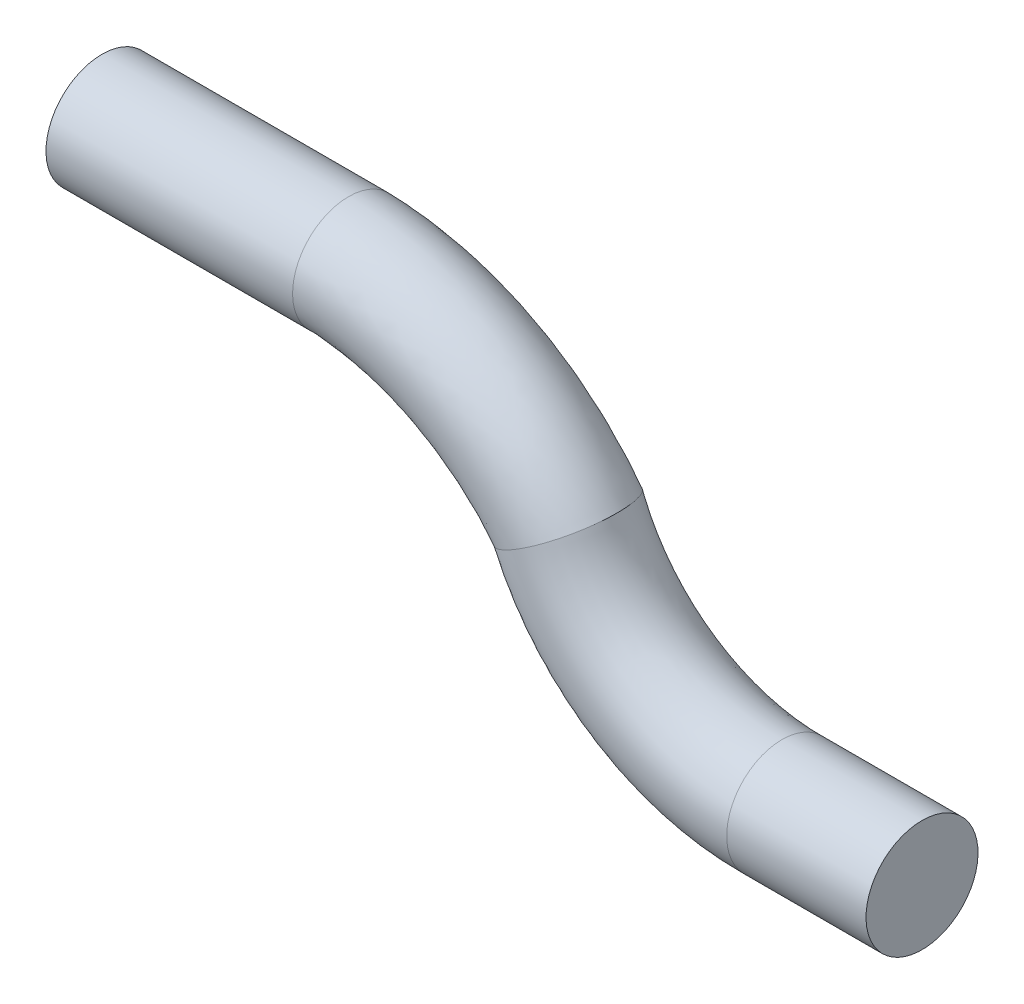
ISO-10303-21;
HEADER;
FILE_DESCRIPTION(('STEP AP214'),'2;1');
FILE_NAME('part.step','',(''),(''),'','','');
FILE_SCHEMA(('AUTOMOTIVE_DESIGN { 1 0 10303 214 1 1 1 1 }'));
ENDSEC;
DATA;
#1=APPLICATION_CONTEXT('core data for automotive mechanical design processes');
#2=APPLICATION_PROTOCOL_DEFINITION('international standard','automotive_design',2000,#1);
#3=PRODUCT_CONTEXT('',#1,'mechanical');
#4=PRODUCT('Part','Part','',(#3));
#5=PRODUCT_RELATED_PRODUCT_CATEGORY('part','',(#4));
#6=PRODUCT_DEFINITION_FORMATION('','',#4);
#7=PRODUCT_DEFINITION_CONTEXT('part definition',#1,'design');
#8=PRODUCT_DEFINITION('design','',#6,#7);
#9=PRODUCT_DEFINITION_SHAPE('','',#8);
#10=(LENGTH_UNIT() NAMED_UNIT(*) SI_UNIT(.MILLI.,.METRE.));
#11=(NAMED_UNIT(*) PLANE_ANGLE_UNIT() SI_UNIT($,.RADIAN.));
#12=(NAMED_UNIT(*) SI_UNIT($,.STERADIAN.) SOLID_ANGLE_UNIT());
#13=UNCERTAINTY_MEASURE_WITH_UNIT(LENGTH_MEASURE(1.E-05),#10,'distance_accuracy_value','');
#14=(GEOMETRIC_REPRESENTATION_CONTEXT(3) GLOBAL_UNCERTAINTY_ASSIGNED_CONTEXT((#13)) GLOBAL_UNIT_ASSIGNED_CONTEXT((#10,
#11,#12)) REPRESENTATION_CONTEXT('',''));
#15=CARTESIAN_POINT('',(0.,0.,0.));
#16=DIRECTION('',(0.,0.,1.));
#17=DIRECTION('',(1.,0.,0.));
#18=AXIS2_PLACEMENT_3D('',#15,#16,#17);
#19=CARTESIAN_POINT('',(271.907836607227,146.761167818452,0.));
#20=DIRECTION('',(1.,0.,0.));
#21=DIRECTION('',(0.,1.,0.));
#22=AXIS2_PLACEMENT_3D('',#19,#20,#21);
#23=PLANE('',#22);
#24=CARTESIAN_POINT('',(271.907836607227,146.761167818452,0.));
#25=DIRECTION('',(1.,0.,0.));
#26=DIRECTION('',(0.,1.,0.));
#27=AXIS2_PLACEMENT_3D('',#24,#25,#26);
#28=CIRCLE('',#27,0.508);
#29=CARTESIAN_POINT('',(271.907836607227,147.269167818452,0.));
#30=VERTEX_POINT('',#29);
#31=EDGE_CURVE('E123',#30,#30,#28,.T.);
#32=ORIENTED_EDGE('',*,*,#31,.T.);
#33=EDGE_LOOP('',(#32));
#34=FACE_BOUND('',#33,.T.);
#35=ADVANCED_FACE('F51',(#34),#23,.T.);
#36=CARTESIAN_POINT('',(264.468981006446,149.061167818451,0.));
#37=DIRECTION('',(1.,0.,0.));
#38=DIRECTION('',(0.,1.,0.));
#39=AXIS2_PLACEMENT_3D('',#36,#37,#38);
#40=PLANE('',#39);
#41=CARTESIAN_POINT('',(264.468981006446,149.061167818451,0.));
#42=DIRECTION('',(1.,0.,0.));
#43=DIRECTION('',(0.,1.,0.));
#44=AXIS2_PLACEMENT_3D('',#41,#42,#43);
#45=CIRCLE('',#44,0.508);
#46=CARTESIAN_POINT('',(264.468981006446,149.569167818451,0.));
#47=VERTEX_POINT('',#46);
#48=EDGE_CURVE('E61',#47,#47,#45,.T.);
#49=ORIENTED_EDGE('',*,*,#48,.F.);
#50=EDGE_LOOP('',(#49));
#51=FACE_BOUND('',#50,.T.);
#52=ADVANCED_FACE('F139',(#51),#40,.F.);
#53=CARTESIAN_POINT('',(270.644067449418,146.761167818452,0.));
#54=DIRECTION('',(1.,0.,0.));
#55=DIRECTION('',(0.,0.,-1.));
#56=AXIS2_PLACEMENT_3D('',#53,#54,#55);
#57=CYLINDRICAL_SURFACE('',#56,0.508);
#58=ORIENTED_EDGE('',*,*,#31,.F.);
#59=EDGE_LOOP('',(#58));
#60=FACE_BOUND('',#59,.T.);
#61=CARTESIAN_POINT('',(270.644067449418,146.761167818452,0.));
#62=DIRECTION('',(0.999910528985932,0.0133766222594766,0.));
#63=DIRECTION('',(-0.0133766222594766,0.999910528985932,0.));
#64=AXIS2_PLACEMENT_3D('',#61,#62,#63);
#65=CIRCLE('',#64,0.508);
#66=CARTESIAN_POINT('',(270.63727212531,147.269122367176,0.));
#67=VERTEX_POINT('',#66);
#68=EDGE_CURVE('E54',#67,#67,#65,.T.);
#69=ORIENTED_EDGE('',*,*,#68,.T.);
#70=EDGE_LOOP('',(#69));
#71=FACE_BOUND('',#70,.T.);
#72=ADVANCED_FACE('F141',(#60,#71),#57,.T.);
#73=CARTESIAN_POINT('',(269.091853438588,148.423831237104,0.));
#74=CARTESIAN_POINT('',(269.117237446685,148.362186313736,0.));
#75=CARTESIAN_POINT('',(269.145724435752,148.292989885013,0.));
#76=CARTESIAN_POINT('',(269.203163655456,148.153540132283,0.));
#77=CARTESIAN_POINT('',(269.233788160211,148.094996057545,0.));
#78=CARTESIAN_POINT('',(269.314478388299,147.96085276086,0.));
#79=CARTESIAN_POINT('',(269.359636370496,147.897161631772,0.));
#80=CARTESIAN_POINT('',(269.508087284083,147.717588265722,0.));
#81=CARTESIAN_POINT('',(269.624440210598,147.613242349391,0.));
#82=CARTESIAN_POINT('',(270.011623301246,147.357686198297,0.));
#83=CARTESIAN_POINT('',(270.319566812847,147.264872172266,0.));
#84=CARTESIAN_POINT('',(270.63727212531,147.269122367177,0.));
#85=CARTESIAN_POINT('',(269.091853438588,148.423831237104,1.016));
#86=CARTESIAN_POINT('',(269.117237446685,148.362186313736,1.016));
#87=CARTESIAN_POINT('',(269.145724435752,148.292989885013,1.016));
#88=CARTESIAN_POINT('',(269.203163655456,148.153540132283,1.016));
#89=CARTESIAN_POINT('',(269.233788160211,148.094996057545,1.016));
#90=CARTESIAN_POINT('',(269.314478388299,147.96085276086,1.016));
#91=CARTESIAN_POINT('',(269.359636370496,147.897161631772,1.016));
#92=CARTESIAN_POINT('',(269.508087284083,147.717588265722,1.016));
#93=CARTESIAN_POINT('',(269.624440210598,147.613242349391,1.016));
#94=CARTESIAN_POINT('',(270.011623301246,147.357686198297,1.016));
#95=CARTESIAN_POINT('',(270.319566812847,147.264872172266,1.016));
#96=CARTESIAN_POINT('',(270.63727212531,147.269122367177,1.016));
#97=CARTESIAN_POINT('',(268.152384806404,148.036978953741,1.016));
#98=CARTESIAN_POINT('',(268.177768814502,147.975334030373,1.016));
#99=CARTESIAN_POINT('',(268.20003575675,147.921232615692,1.016));
#100=CARTESIAN_POINT('',(268.273509903114,147.742868775952,1.016));
#101=CARTESIAN_POINT('',(268.336990345924,147.614800867698,1.016));
#102=CARTESIAN_POINT('',(268.470021359161,147.393643744945,1.016));
#103=CARTESIAN_POINT('',(268.544471664611,147.288638521412,1.016));
#104=CARTESIAN_POINT('',(268.789217229468,146.992582513104,1.016));
#105=CARTESIAN_POINT('',(268.981044022806,146.820551236128,1.016));
#106=CARTESIAN_POINT('',(269.61937855329,146.399225202889,1.016));
#107=CARTESIAN_POINT('',(270.127073702297,146.2462061296,1.016));
#108=CARTESIAN_POINT('',(270.650862773526,146.253213269727,1.016));
#109=CARTESIAN_POINT('',(268.152384806404,148.036978953741,0.));
#110=CARTESIAN_POINT('',(268.177768814502,147.975334030373,0.));
#111=CARTESIAN_POINT('',(268.20003575675,147.921232615692,0.));
#112=CARTESIAN_POINT('',(268.273509903114,147.742868775952,0.));
#113=CARTESIAN_POINT('',(268.336990345924,147.614800867698,0.));
#114=CARTESIAN_POINT('',(268.470021359161,147.393643744945,0.));
#115=CARTESIAN_POINT('',(268.544471664611,147.288638521412,0.));
#116=CARTESIAN_POINT('',(268.789217229468,146.992582513104,0.));
#117=CARTESIAN_POINT('',(268.981044022806,146.820551236128,0.));
#118=CARTESIAN_POINT('',(269.61937855329,146.399225202889,0.));
#119=CARTESIAN_POINT('',(270.127073702297,146.2462061296,0.));
#120=CARTESIAN_POINT('',(270.650862773526,146.253213269727,0.));
#121=CARTESIAN_POINT('',(268.152384806404,148.036978953741,-1.016));
#122=CARTESIAN_POINT('',(268.177768814502,147.975334030373,-1.016));
#123=CARTESIAN_POINT('',(268.20003575675,147.921232615692,-1.016));
#124=CARTESIAN_POINT('',(268.273509903114,147.742868775952,-1.016));
#125=CARTESIAN_POINT('',(268.336990345924,147.614800867698,-1.016));
#126=CARTESIAN_POINT('',(268.470021359161,147.393643744945,-1.016));
#127=CARTESIAN_POINT('',(268.544471664611,147.288638521412,-1.016));
#128=CARTESIAN_POINT('',(268.789217229468,146.992582513104,-1.016));
#129=CARTESIAN_POINT('',(268.981044022806,146.820551236128,-1.016));
#130=CARTESIAN_POINT('',(269.61937855329,146.399225202889,-1.016));
#131=CARTESIAN_POINT('',(270.127073702297,146.2462061296,-1.016));
#132=CARTESIAN_POINT('',(270.650862773526,146.253213269727,-1.016));
#133=CARTESIAN_POINT('',(269.091853438588,148.423831237104,-1.016));
#134=CARTESIAN_POINT('',(269.117237446685,148.362186313736,-1.016));
#135=CARTESIAN_POINT('',(269.145724435752,148.292989885013,-1.016));
#136=CARTESIAN_POINT('',(269.203163655456,148.153540132283,-1.016));
#137=CARTESIAN_POINT('',(269.233788160211,148.094996057545,-1.016));
#138=CARTESIAN_POINT('',(269.314478388299,147.96085276086,-1.016));
#139=CARTESIAN_POINT('',(269.359636370496,147.897161631772,-1.016));
#140=CARTESIAN_POINT('',(269.508087284083,147.717588265722,-1.016));
#141=CARTESIAN_POINT('',(269.624440210598,147.613242349391,-1.016));
#142=CARTESIAN_POINT('',(270.011623301246,147.357686198297,-1.016));
#143=CARTESIAN_POINT('',(270.319566812847,147.264872172266,-1.016));
#144=CARTESIAN_POINT('',(270.63727212531,147.269122367177,-1.016));
#145=CARTESIAN_POINT('',(269.091853438588,148.423831237104,0.));
#146=CARTESIAN_POINT('',(269.117237446685,148.362186313736,0.));
#147=CARTESIAN_POINT('',(269.145724435752,148.292989885013,0.));
#148=CARTESIAN_POINT('',(269.203163655456,148.153540132283,0.));
#149=CARTESIAN_POINT('',(269.233788160211,148.094996057545,0.));
#150=CARTESIAN_POINT('',(269.314478388299,147.96085276086,0.));
#151=CARTESIAN_POINT('',(269.359636370496,147.897161631772,0.));
#152=CARTESIAN_POINT('',(269.508087284083,147.717588265722,0.));
#153=CARTESIAN_POINT('',(269.624440210598,147.613242349391,0.));
#154=CARTESIAN_POINT('',(270.011623301246,147.357686198297,0.));
#155=CARTESIAN_POINT('',(270.319566812847,147.264872172266,0.));
#156=CARTESIAN_POINT('',(270.63727212531,147.269122367177,0.));
#157=(BOUNDED_SURFACE() B_SPLINE_SURFACE(3,3,((#73,#74,#75,#76,#77,#78,#79,#80,#81,#82,#83,#84),
(#85,#86,#87,#88,#89,#90,#91,#92,#93,#94,#95,#96),(#97,#98,#99,#100,#101,#102,#103,#104,#105,
#106,#107,#108),(#109,#110,#111,#112,#113,#114,#115,#116,#117,#118,#119,#120),(#121,#122,#123,
#124,#125,#126,#127,#128,#129,#130,#131,#132),(#133,#134,#135,#136,#137,#138,#139,#140,#141,
#142,#143,#144),(#145,#146,#147,#148,#149,#150,#151,#152,#153,#154,#155,#156)),.UNSPECIFIED.,
.T.,.F.,.F.) B_SPLINE_SURFACE_WITH_KNOTS((4,3,4),(4,2,2,2,2,4),(0.,0.5,1.),(-0.0792170525621937,
0.,0.125,0.25,0.5,1.),
.UNSPECIFIED.) GEOMETRIC_REPRESENTATION_ITEM() RATIONAL_B_SPLINE_SURFACE(((1.,1.,1.,1.,1.,1.,1.,
1.,1.,1.,1.,1.),(0.333333333333333,0.333333333333333,0.333333333333333,0.333333333333333,
0.333333333333333,0.333333333333333,0.333333333333333,0.333333333333333,0.333333333333333,
0.333333333333333,0.333333333333333,0.333333333333333),(0.333333333333333,0.333333333333333,
0.333333333333333,0.333333333333333,0.333333333333333,0.333333333333333,0.333333333333333,
0.333333333333333,0.333333333333333,0.333333333333333,0.333333333333333,0.333333333333333),(1.,
1.,1.,1.,1.,1.,1.,1.,1.,1.,1.,1.),(0.333333333333333,0.333333333333333,0.333333333333333,
0.333333333333333,0.333333333333333,0.333333333333333,0.333333333333333,0.333333333333333,
0.333333333333333,0.333333333333333,0.333333333333333,0.333333333333333),(0.333333333333333,
0.333333333333333,0.333333333333333,0.333333333333333,0.333333333333333,0.333333333333333,
0.333333333333333,0.333333333333333,0.333333333333333,0.333333333333333,0.333333333333333,
0.333333333333333),(1.,1.,1.,1.,1.,1.,1.,1.,1.,1.,1.,1.))) REPRESENTATION_ITEM('') SURFACE());
#158=CARTESIAN_POINT('',(268.69827114678,148.045470325308,-0.508));
#159=CARTESIAN_POINT('',(268.700802021401,148.046934073896,-0.508000126012944));
#160=CARTESIAN_POINT('',(268.703333387043,148.048398101966,-0.507975312492676));
#161=CARTESIAN_POINT('',(268.730914551733,148.064349759092,-0.507433654173156));
#162=CARTESIAN_POINT('',(268.755971246846,148.078840945927,-0.504503439107406));
#163=CARTESIAN_POINT('',(268.805350082667,148.107397729755,-0.493827790988958));
#164=CARTESIAN_POINT('',(268.82967010621,148.121462100277,-0.48606964788327));
#165=CARTESIAN_POINT('',(268.87681337888,148.148724625947,-0.465948513078156));
#166=CARTESIAN_POINT('',(268.899638324636,148.161923762984,-0.453590851286754));
#167=CARTESIAN_POINT('',(268.943158270964,148.187089877168,-0.424605203263094));
#168=CARTESIAN_POINT('',(268.963853152723,148.199056785584,-0.407976979004063));
#169=CARTESIAN_POINT('',(269.002423150721,148.221359749554,-0.370992464790322));
#170=CARTESIAN_POINT('',(269.020310146738,148.231702675994,-0.350652714486624));
#171=CARTESIAN_POINT('',(269.052845159875,148.250515443119,-0.306764052580676));
#172=CARTESIAN_POINT('',(269.067492917754,148.258985133885,-0.283214884367068));
#173=CARTESIAN_POINT('',(269.092996086557,148.273731589872,-0.233795404930973));
#174=CARTESIAN_POINT('',(269.103883135528,148.28002664983,-0.20794687982292));
#175=CARTESIAN_POINT('',(269.121711900865,148.290335477874,-0.154494388125926));
#176=CARTESIAN_POINT('',(269.128653866137,148.294349389885,-0.126890532408309));
#177=CARTESIAN_POINT('',(269.138344489264,148.299952594525,-0.0709416740323016));
#178=CARTESIAN_POINT('',(269.141125377454,148.301560523112,-0.0426041159351496));
#179=CARTESIAN_POINT('',(269.142512806573,148.302362744695,0.0142067001503099));
#180=CARTESIAN_POINT('',(269.141119457772,148.301557101451,0.0426799545340638));
#181=CARTESIAN_POINT('',(269.134213032068,148.297563750306,0.0988472364798038));
#182=CARTESIAN_POINT('',(269.128714683225,148.294384558307,0.126543683393451));
#183=CARTESIAN_POINT('',(269.11377907239,148.285748617266,0.180481372838089));
#184=CARTESIAN_POINT('',(269.10434169529,148.280291801669,0.206722572817833));
#185=CARTESIAN_POINT('',(269.081780942272,148.267246777471,0.257071351433603));
#186=CARTESIAN_POINT('',(269.068649403898,148.259653849008,0.281174048016246));
#187=CARTESIAN_POINT('',(269.039093580099,148.242563874487,0.326511601989786));
#188=CARTESIAN_POINT('',(269.022669429995,148.23306690668,0.347746577179447));
#189=CARTESIAN_POINT('',(268.986710734822,148.212274146456,0.387088330113536));
#190=CARTESIAN_POINT('',(268.967130340771,148.200951837941,0.405139196840326));
#191=CARTESIAN_POINT('',(268.925625100811,148.176951104855,0.437186953156697));
#192=CARTESIAN_POINT('',(268.903700295506,148.16427270377,0.451183912940618));
#193=CARTESIAN_POINT('',(268.858117624553,148.137913133239,0.474756392281489));
#194=CARTESIAN_POINT('',(268.83445822214,148.124231074598,0.48432793493652));
#195=CARTESIAN_POINT('',(268.786128546124,148.096281637945,0.49875905554546));
#196=CARTESIAN_POINT('',(268.761460641822,148.082015631732,0.503629082720121));
#197=CARTESIAN_POINT('',(268.72640178631,148.061739714604,0.507115130333384));
#198=CARTESIAN_POINT('',(268.71613604281,148.0558025602,0.507724410062004));
#199=CARTESIAN_POINT('',(268.703333829821,148.048398357986,0.50797517439617));
#200=CARTESIAN_POINT('',(268.700802503328,148.046934352548,0.507999970753963));
#201=CARTESIAN_POINT('',(268.69827114678,148.045470325308,0.508));
#202=B_SPLINE_CURVE_WITH_KNOTS('',3,(#158,#159,#160,#161,#162,#163,#164,#165,#166,#167,#168,
#169,#170,#171,#172,#173,#174,#175,#176,#177,#178,#179,#180,#181,#182,#183,#184,#185,#186,#187,
#188,#189,#190,#191,#192,#193,#194,#195,#196,#197,#198,#199,#200,#201),.UNSPECIFIED.,.F.,.F.,(4,
2,2,2,2,2,2,2,2,2,2,2,2,2,2,2,2,2,2,2,2,4),(0.,0.00877255595995308,0.0955810199251461,
0.182618989209493,0.269556411595565,0.356498680632854,0.443062573050975,0.529633390813485,
0.615457077623758,0.701275348957075,0.786425395562704,0.871573192763258,0.956416953086349,
1.0412631929243,1.12629839795527,1.21133010889129,1.29773178326818,1.38413196149056,
1.47060963305505,1.55689466058532,1.59249523592678,1.60126779188686),.UNSPECIFIED.);
#203=CARTESIAN_POINT('',(268.69827114678,148.045470325308,0.508));
#204=VERTEX_POINT('',#203);
#205=CARTESIAN_POINT('',(268.69827114678,148.045470325308,-0.508));
#206=VERTEX_POINT('',#205);
#207=EDGE_CURVE('E70',#204,#206,#202,.F.);
#208=CARTESIAN_POINT('',(268.69827114678,148.045470325308,-0.508));
#209=CARTESIAN_POINT('',(268.69574026672,148.044006586837,-0.508000125521016));
#210=CARTESIAN_POINT('',(268.693209272455,148.042541916219,-0.507975312075906));
#211=CARTESIAN_POINT('',(268.665657358106,148.02658842166,-0.507434066453992));
#212=CARTESIAN_POINT('',(268.640665843393,148.012033312633,-0.504508348191352));
#213=CARTESIAN_POINT('',(268.59148564628,147.983228770008,-0.493848090735364));
#214=CARTESIAN_POINT('',(268.567299257266,147.968980244725,-0.486100878034924));
#215=CARTESIAN_POINT('',(268.520477460907,147.94125219841,-0.46600586460558));
#216=CARTESIAN_POINT('',(268.497840315893,147.927771818746,-0.453663321647341));
#217=CARTESIAN_POINT('',(268.454730452793,147.901980541764,-0.424711049631758));
#218=CARTESIAN_POINT('',(268.434257856394,147.889669710199,-0.408101080845827));
#219=CARTESIAN_POINT('',(268.396144433278,147.866660709011,-0.371159292019948));
#220=CARTESIAN_POINT('',(268.378491198381,147.855955486444,-0.350844673372808));
#221=CARTESIAN_POINT('',(268.346405258303,147.83643712011,-0.307010438456557));
#222=CARTESIAN_POINT('',(268.331972821093,147.82762413378,-0.283490555771157));
#223=CARTESIAN_POINT('',(268.306847924414,147.812246710337,-0.234120347591559));
#224=CARTESIAN_POINT('',(268.296126021682,147.805664580323,-0.208290516366131));
#225=CARTESIAN_POINT('',(268.278566815695,147.794869623037,-0.15487545835416));
#226=CARTESIAN_POINT('',(268.271729293531,147.790656662247,-0.127290330587233));
#227=CARTESIAN_POINT('',(268.262168345098,147.784762278529,-0.0713538722247002));
#228=CARTESIAN_POINT('',(268.259416609394,147.783063436151,-0.0430092125426383));
#229=CARTESIAN_POINT('',(268.258015365196,147.782198590403,0.013819500877205));
#230=CARTESIAN_POINT('',(268.259365758653,147.783032526496,0.0423035512670091));
#231=CARTESIAN_POINT('',(268.266119366373,147.787198549912,0.0985085044989186));
#232=CARTESIAN_POINT('',(268.271509822865,147.790522773353,0.126231525458183));
#233=CARTESIAN_POINT('',(268.28617637922,147.799549998079,0.180224484793484));
#234=CARTESIAN_POINT('',(268.295452574469,147.805253057758,0.20649438748078));
#235=CARTESIAN_POINT('',(268.317652163758,147.818864464906,0.256894024549982));
#236=CARTESIAN_POINT('',(268.330582682021,147.826777119692,0.281019456233612));
#237=CARTESIAN_POINT('',(268.359721072779,147.844546172896,0.326400528180042));
#238=CARTESIAN_POINT('',(268.375928687136,147.854402418215,0.347656394260339));
#239=CARTESIAN_POINT('',(268.411285152679,147.875814248487,0.386843344946719));
#240=CARTESIAN_POINT('',(268.430451774216,147.887380081235,0.404752792180939));
#241=CARTESIAN_POINT('',(268.471121399442,147.911803898673,0.436594490772738));
#242=CARTESIAN_POINT('',(268.492624374062,147.924661867288,0.450526791603199));
#243=CARTESIAN_POINT('',(268.537736603444,147.951494656578,0.474234729225177));
#244=CARTESIAN_POINT('',(268.561374313791,147.965484184429,0.483939446544052));
#245=CARTESIAN_POINT('',(268.609748614587,147.993949639749,0.498581004140133));
#246=CARTESIAN_POINT('',(268.634482668977,148.008424427555,0.503528302939986));
#247=CARTESIAN_POINT('',(268.669805636769,148.028976028996,0.50709431481724));
#248=CARTESIAN_POINT('',(268.680236146072,148.035030085869,0.507720991792742));
#249=CARTESIAN_POINT('',(268.693208838426,148.042541652635,0.50797517482282));
#250=CARTESIAN_POINT('',(268.695739794986,148.044006299584,0.507999971354372));
#251=CARTESIAN_POINT('',(268.69827114678,148.045470325308,0.508));
#252=B_SPLINE_CURVE_WITH_KNOTS('',3,(#208,#209,#210,#211,#212,#213,#214,#215,#216,#217,#218,
#219,#220,#221,#222,#223,#224,#225,#226,#227,#228,#229,#230,#231,#232,#233,#234,#235,#236,#237,
#238,#239,#240,#241,#242,#243,#244,#245,#246,#247,#248,#249,#250,#251),.UNSPECIFIED.,.F.,.F.,(4,
2,2,2,2,2,2,2,2,2,2,2,2,2,2,2,2,2,2,2,2,4),(0.,0.00877255624368462,0.0955078199601894,
0.182472039637776,0.269337063010097,0.356206967213421,0.442683338297489,0.529166901544571,
0.614947570924361,0.700723405536112,0.785902100580178,0.871078759690817,0.955987574004032,
1.04089847276169,1.12597606373579,1.21104695570933,1.29665018472614,1.38225234885307,
1.46923987699717,1.55603573500843,1.59224031107963,1.60101286732336),.UNSPECIFIED.);
#253=EDGE_CURVE('E68',#204,#206,#252,.F.);
#254=ORIENTED_EDGE('',*,*,#207,.F.);
#255=ORIENTED_EDGE('',*,*,#253,.T.);
#256=EDGE_LOOP('',(#254,#255));
#257=FACE_BOUND('',#256,.T.);
#258=ORIENTED_EDGE('',*,*,#68,.F.);
#259=EDGE_LOOP('',(#258));
#260=FACE_BOUND('',#259,.T.);
#261=ADVANCED_FACE('F71',(#257,#260),#157,.T.);
#262=CARTESIAN_POINT('',(266.721329115427,149.568938516314,0.));
#263=CARTESIAN_POINT('',(267.184857953847,149.555006590077,0.));
#264=CARTESIAN_POINT('',(267.638584503625,149.437545372252,0.));
#265=CARTESIAN_POINT('',(268.250992516168,149.125317619396,0.));
#266=CARTESIAN_POINT('',(268.443630476031,148.998746689766,0.));
#267=CARTESIAN_POINT('',(268.797369730022,148.705836005171,0.));
#268=CARTESIAN_POINT('',(268.969982868982,148.524628207888,0.));
#269=CARTESIAN_POINT('',(269.144973238073,148.298211165435,0.));
#270=CARTESIAN_POINT('',(269.18177358285,148.250573158274,0.));
#271=CARTESIAN_POINT('',(269.222535895213,148.197820164661,0.));
#272=CARTESIAN_POINT('',(266.721329115427,149.568938516314,1.016));
#273=CARTESIAN_POINT('',(267.184857953847,149.555006590077,1.016));
#274=CARTESIAN_POINT('',(267.638584503625,149.437545372252,1.016));
#275=CARTESIAN_POINT('',(268.250992516168,149.125317619396,1.016));
#276=CARTESIAN_POINT('',(268.443630476031,148.998746689766,1.016));
#277=CARTESIAN_POINT('',(268.797369730022,148.705836005171,1.016));
#278=CARTESIAN_POINT('',(268.969982868982,148.524628207888,1.016));
#279=CARTESIAN_POINT('',(269.144973238073,148.298211165435,1.016));
#280=CARTESIAN_POINT('',(269.18177358285,148.250573158274,1.016));
#281=CARTESIAN_POINT('',(269.222535895213,148.197820164661,1.016));
#282=CARTESIAN_POINT('',(266.690805787176,148.553397120588,1.016));
#283=CARTESIAN_POINT('',(267.003632543669,148.543994729749,1.016));
#284=CARTESIAN_POINT('',(267.309843922836,148.464722398166,1.016));
#285=CARTESIAN_POINT('',(267.723146389345,148.25400585344,1.016));
#286=CARTESIAN_POINT('',(267.853154067755,148.1685855514,1.016));
#287=CARTESIAN_POINT('',(268.091885931443,147.970905726958,1.016));
#288=CARTESIAN_POINT('',(268.189079151121,147.873589469661,1.016));
#289=CARTESIAN_POINT('',(268.333103200725,147.687232007949,1.016));
#290=CARTESIAN_POINT('',(268.377817960157,147.629355517876,1.016));
#291=CARTESIAN_POINT('',(268.41858027252,147.576602524264,1.016));
#292=CARTESIAN_POINT('',(266.690805787176,148.553397120588,0.));
#293=CARTESIAN_POINT('',(267.003632543669,148.543994729749,0.));
#294=CARTESIAN_POINT('',(267.309843922836,148.464722398166,0.));
#295=CARTESIAN_POINT('',(267.723146389345,148.25400585344,0.));
#296=CARTESIAN_POINT('',(267.853154067755,148.1685855514,0.));
#297=CARTESIAN_POINT('',(268.091885931443,147.970905726958,0.));
#298=CARTESIAN_POINT('',(268.189079151121,147.873589469661,0.));
#299=CARTESIAN_POINT('',(268.333103200725,147.687232007949,0.));
#300=CARTESIAN_POINT('',(268.377817960157,147.629355517876,0.));
#301=CARTESIAN_POINT('',(268.41858027252,147.576602524264,0.));
#302=CARTESIAN_POINT('',(266.690805787176,148.553397120588,-1.016));
#303=CARTESIAN_POINT('',(267.003632543669,148.543994729749,-1.016));
#304=CARTESIAN_POINT('',(267.309843922836,148.464722398166,-1.016));
#305=CARTESIAN_POINT('',(267.723146389345,148.25400585344,-1.016));
#306=CARTESIAN_POINT('',(267.853154067755,148.1685855514,-1.016));
#307=CARTESIAN_POINT('',(268.091885931443,147.970905726958,-1.016));
#308=CARTESIAN_POINT('',(268.189079151121,147.873589469661,-1.016));
#309=CARTESIAN_POINT('',(268.333103200725,147.687232007949,-1.016));
#310=CARTESIAN_POINT('',(268.377817960157,147.629355517876,-1.016));
#311=CARTESIAN_POINT('',(268.41858027252,147.576602524264,-1.016));
#312=CARTESIAN_POINT('',(266.721329115427,149.568938516314,-1.016));
#313=CARTESIAN_POINT('',(267.184857953847,149.555006590077,-1.016));
#314=CARTESIAN_POINT('',(267.638584503625,149.437545372252,-1.016));
#315=CARTESIAN_POINT('',(268.250992516168,149.125317619396,-1.016));
#316=CARTESIAN_POINT('',(268.443630476031,148.998746689766,-1.016));
#317=CARTESIAN_POINT('',(268.797369730022,148.705836005171,-1.016));
#318=CARTESIAN_POINT('',(268.969982868982,148.524628207888,-1.016));
#319=CARTESIAN_POINT('',(269.144973238073,148.298211165435,-1.016));
#320=CARTESIAN_POINT('',(269.18177358285,148.250573158274,-1.016));
#321=CARTESIAN_POINT('',(269.222535895213,148.197820164661,-1.016));
#322=CARTESIAN_POINT('',(266.721329115427,149.568938516314,0.));
#323=CARTESIAN_POINT('',(267.184857953847,149.555006590077,0.));
#324=CARTESIAN_POINT('',(267.638584503625,149.437545372252,0.));
#325=CARTESIAN_POINT('',(268.250992516168,149.125317619396,0.));
#326=CARTESIAN_POINT('',(268.443630476031,148.998746689766,0.));
#327=CARTESIAN_POINT('',(268.797369730022,148.705836005171,0.));
#328=CARTESIAN_POINT('',(268.969982868982,148.524628207888,0.));
#329=CARTESIAN_POINT('',(269.144973238073,148.298211165435,0.));
#330=CARTESIAN_POINT('',(269.18177358285,148.250573158274,0.));
#331=CARTESIAN_POINT('',(269.222535895213,148.197820164661,0.));
#332=(BOUNDED_SURFACE() B_SPLINE_SURFACE(3,3,((#262,#263,#264,#265,#266,#267,#268,#269,#270,
#271),(#272,#273,#274,#275,#276,#277,#278,#279,#280,#281),(#282,#283,#284,#285,#286,#287,#288,
#289,#290,#291),(#292,#293,#294,#295,#296,#297,#298,#299,#300,#301),(#302,#303,#304,#305,#306,
#307,#308,#309,#310,#311),(#312,#313,#314,#315,#316,#317,#318,#319,#320,#321),(#322,#323,#324,
#325,#326,#327,#328,#329,#330,#331)),.UNSPECIFIED.,.T.,.F.,.F.) B_SPLINE_SURFACE_WITH_KNOTS((4,
3,4),(4,2,2,2,4),(0.,0.5,1.),(0.,0.5,0.75,1.,1.08583254521561),
.UNSPECIFIED.) GEOMETRIC_REPRESENTATION_ITEM() RATIONAL_B_SPLINE_SURFACE(((1.,1.,1.,1.,1.,1.,1.,
1.,1.,1.),(0.333333333333333,0.333333333333333,0.333333333333333,0.333333333333333,
0.333333333333333,0.333333333333333,0.333333333333333,0.333333333333333,0.333333333333333,
0.333333333333333),(0.333333333333333,0.333333333333333,0.333333333333333,0.333333333333333,
0.333333333333333,0.333333333333333,0.333333333333333,0.333333333333333,0.333333333333333,
0.333333333333333),(1.,1.,1.,1.,1.,1.,1.,1.,1.,1.),(0.333333333333333,0.333333333333333,
0.333333333333333,0.333333333333333,0.333333333333333,0.333333333333333,0.333333333333333,
0.333333333333333,0.333333333333333,0.333333333333333),(0.333333333333333,0.333333333333333,
0.333333333333333,0.333333333333333,0.333333333333333,0.333333333333333,0.333333333333333,
0.333333333333333,0.333333333333333,0.333333333333333),(1.,1.,1.,1.,1.,1.,1.,1.,1.,1.))) REPRESENTATION_ITEM('') SURFACE());
#333=CARTESIAN_POINT('',(266.706067451301,149.061167818451,0.));
#334=DIRECTION('',(1.,0.,0.));
#335=DIRECTION('',(0.,1.,0.));
#336=AXIS2_PLACEMENT_3D('',#333,#334,#335);
#337=CIRCLE('',#336,0.508);
#338=CARTESIAN_POINT('',(266.706067451301,149.569167818451,0.));
#339=VERTEX_POINT('',#338);
#340=EDGE_CURVE('E12',#339,#339,#337,.T.);
#341=CARTESIAN_POINT('',(266.708535719487,149.569323037478,0.));
#342=CARTESIAN_POINT('',(266.7128001848,149.569194863757,0.));
#343=CARTESIAN_POINT('',(266.717064650113,149.569066690035,0.));
#344=CARTESIAN_POINT('',(266.721329115427,149.568938516314,0.));
#345=CARTESIAN_POINT('',(267.184857953847,149.555006590077,0.));
#346=CARTESIAN_POINT('',(267.638584503625,149.437545372252,0.));
#347=CARTESIAN_POINT('',(268.250992516168,149.125317619396,0.));
#348=CARTESIAN_POINT('',(268.443630476031,148.998746689766,0.));
#349=CARTESIAN_POINT('',(268.797369730022,148.705836005171,0.));
#350=CARTESIAN_POINT('',(268.969982868982,148.524628207888,0.));
#351=CARTESIAN_POINT('',(269.144973238073,148.298211165435,0.));
#352=CARTESIAN_POINT('',(269.18177358285,148.250573158274,0.));
#353=CARTESIAN_POINT('',(269.222535895213,148.197820164661,0.));
#354=CARTESIAN_POINT('',(266.708535719486,149.569323037478,1.016));
#355=CARTESIAN_POINT('',(266.7128001848,149.569194863757,1.016));
#356=CARTESIAN_POINT('',(266.717064650113,149.569066690035,1.016));
#357=CARTESIAN_POINT('',(266.721329115427,149.568938516314,1.016));
#358=CARTESIAN_POINT('',(267.184857953847,149.555006590077,1.016));
#359=CARTESIAN_POINT('',(267.638584503625,149.437545372252,1.016));
#360=CARTESIAN_POINT('',(268.250992516168,149.125317619396,1.016));
#361=CARTESIAN_POINT('',(268.443630476031,148.998746689766,1.016));
#362=CARTESIAN_POINT('',(268.797369730022,148.705836005171,1.016));
#363=CARTESIAN_POINT('',(268.969982868982,148.524628207888,1.016));
#364=CARTESIAN_POINT('',(269.144973238073,148.298211165435,1.016));
#365=CARTESIAN_POINT('',(269.18177358285,148.250573158274,1.016));
#366=CARTESIAN_POINT('',(269.222535895213,148.197820164661,1.016));
#367=CARTESIAN_POINT('',(266.682171768697,148.553656626575,1.016));
#368=CARTESIAN_POINT('',(266.685049774856,148.55357012458,1.016));
#369=CARTESIAN_POINT('',(266.687927781016,148.553483622584,1.016));
#370=CARTESIAN_POINT('',(266.690805787176,148.553397120588,1.016));
#371=CARTESIAN_POINT('',(267.003632543669,148.543994729749,1.016));
#372=CARTESIAN_POINT('',(267.309843922836,148.464722398166,1.016));
#373=CARTESIAN_POINT('',(267.723146389345,148.25400585344,1.016));
#374=CARTESIAN_POINT('',(267.853154067755,148.1685855514,1.016));
#375=CARTESIAN_POINT('',(268.091885931443,147.970905726958,1.016));
#376=CARTESIAN_POINT('',(268.189079151121,147.873589469661,1.016));
#377=CARTESIAN_POINT('',(268.333103200725,147.687232007949,1.016));
#378=CARTESIAN_POINT('',(268.377817960157,147.629355517876,1.016));
#379=CARTESIAN_POINT('',(268.41858027252,147.576602524264,1.016));
#380=CARTESIAN_POINT('',(266.682171768697,148.553656626575,0.));
#381=CARTESIAN_POINT('',(266.685049774856,148.55357012458,0.));
#382=CARTESIAN_POINT('',(266.687927781016,148.553483622584,0.));
#383=CARTESIAN_POINT('',(266.690805787176,148.553397120588,0.));
#384=CARTESIAN_POINT('',(267.003632543669,148.543994729749,0.));
#385=CARTESIAN_POINT('',(267.309843922836,148.464722398166,0.));
#386=CARTESIAN_POINT('',(267.723146389345,148.25400585344,0.));
#387=CARTESIAN_POINT('',(267.853154067755,148.1685855514,0.));
#388=CARTESIAN_POINT('',(268.091885931443,147.970905726958,0.));
#389=CARTESIAN_POINT('',(268.189079151121,147.873589469661,0.));
#390=CARTESIAN_POINT('',(268.333103200725,147.687232007949,0.));
#391=CARTESIAN_POINT('',(268.377817960157,147.629355517876,0.));
#392=CARTESIAN_POINT('',(268.41858027252,147.576602524264,0.));
#393=CARTESIAN_POINT('',(266.682171768697,148.553656626575,-1.016));
#394=CARTESIAN_POINT('',(266.685049774856,148.55357012458,-1.016));
#395=CARTESIAN_POINT('',(266.687927781016,148.553483622584,-1.016));
#396=CARTESIAN_POINT('',(266.690805787176,148.553397120588,-1.016));
#397=CARTESIAN_POINT('',(267.003632543669,148.543994729749,-1.016));
#398=CARTESIAN_POINT('',(267.309843922836,148.464722398166,-1.016));
#399=CARTESIAN_POINT('',(267.723146389345,148.25400585344,-1.016));
#400=CARTESIAN_POINT('',(267.853154067755,148.1685855514,-1.016));
#401=CARTESIAN_POINT('',(268.091885931443,147.970905726958,-1.016));
#402=CARTESIAN_POINT('',(268.189079151121,147.873589469661,-1.016));
#403=CARTESIAN_POINT('',(268.333103200725,147.687232007949,-1.016));
#404=CARTESIAN_POINT('',(268.377817960157,147.629355517876,-1.016));
#405=CARTESIAN_POINT('',(268.41858027252,147.576602524264,-1.016));
#406=CARTESIAN_POINT('',(266.708535719486,149.569323037478,-1.016));
#407=CARTESIAN_POINT('',(266.7128001848,149.569194863757,-1.016));
#408=CARTESIAN_POINT('',(266.717064650113,149.569066690035,-1.016));
#409=CARTESIAN_POINT('',(266.721329115427,149.568938516314,-1.016));
#410=CARTESIAN_POINT('',(267.184857953847,149.555006590077,-1.016));
#411=CARTESIAN_POINT('',(267.638584503625,149.437545372252,-1.016));
#412=CARTESIAN_POINT('',(268.250992516168,149.125317619396,-1.016));
#413=CARTESIAN_POINT('',(268.443630476031,148.998746689766,-1.016));
#414=CARTESIAN_POINT('',(268.797369730022,148.705836005171,-1.016));
#415=CARTESIAN_POINT('',(268.969982868982,148.524628207888,-1.016));
#416=CARTESIAN_POINT('',(269.144973238073,148.298211165435,-1.016));
#417=CARTESIAN_POINT('',(269.18177358285,148.250573158274,-1.016));
#418=CARTESIAN_POINT('',(269.222535895213,148.197820164661,-1.016));
#419=CARTESIAN_POINT('',(266.708535719487,149.569323037478,0.));
#420=CARTESIAN_POINT('',(266.7128001848,149.569194863757,0.));
#421=CARTESIAN_POINT('',(266.717064650113,149.569066690035,0.));
#422=CARTESIAN_POINT('',(266.721329115427,149.568938516314,0.));
#423=CARTESIAN_POINT('',(267.184857953847,149.555006590077,0.));
#424=CARTESIAN_POINT('',(267.638584503625,149.437545372252,0.));
#425=CARTESIAN_POINT('',(268.250992516168,149.125317619396,0.));
#426=CARTESIAN_POINT('',(268.443630476031,148.998746689766,0.));
#427=CARTESIAN_POINT('',(268.797369730022,148.705836005171,0.));
#428=CARTESIAN_POINT('',(268.969982868982,148.524628207888,0.));
#429=CARTESIAN_POINT('',(269.144973238073,148.298211165435,0.));
#430=CARTESIAN_POINT('',(269.18177358285,148.250573158274,0.));
#431=CARTESIAN_POINT('',(269.222535895213,148.197820164661,0.));
#432=(BOUNDED_SURFACE() B_SPLINE_SURFACE(3,3,((#341,#342,#343,#344,#345,#346,#347,#348,#349,
#350,#351,#352,#353),(#354,#355,#356,#357,#358,#359,#360,#361,#362,#363,#364,#365,#366),(#367,
#368,#369,#370,#371,#372,#373,#374,#375,#376,#377,#378,#379),(#380,#381,#382,#383,#384,#385,
#386,#387,#388,#389,#390,#391,#392),(#393,#394,#395,#396,#397,#398,#399,#400,#401,#402,#403,
#404,#405),(#406,#407,#408,#409,#410,#411,#412,#413,#414,#415,#416,#417,#418),(#419,#420,#421,
#422,#423,#424,#425,#426,#427,#428,#429,#430,#431)),.UNSPECIFIED.,.T.,.F.,
.F.) B_SPLINE_SURFACE_WITH_KNOTS((4,3,4),(4,3,2,2,2,4),(0.,0.5,1.),(-0.0046,0.,0.5,0.75,1.,
1.08583254521561),.UNSPECIFIED.) GEOMETRIC_REPRESENTATION_ITEM() RATIONAL_B_SPLINE_SURFACE(((1.,
1.,1.,1.,1.,1.,1.,1.,1.,1.,1.,1.,1.),(0.333333333333333,0.333333333333333,0.333333333333333,
0.333333333333333,0.333333333333333,0.333333333333333,0.333333333333333,0.333333333333333,
0.333333333333333,0.333333333333333,0.333333333333333,0.333333333333333,0.333333333333333),
(0.333333333333333,0.333333333333333,0.333333333333333,0.333333333333333,0.333333333333333,
0.333333333333333,0.333333333333333,0.333333333333333,0.333333333333333,0.333333333333333,
0.333333333333333,0.333333333333333,0.333333333333333),(1.,1.,1.,1.,1.,1.,1.,1.,1.,1.,1.,1.,1.),
(0.333333333333333,0.333333333333333,0.333333333333333,0.333333333333333,0.333333333333333,
0.333333333333333,0.333333333333333,0.333333333333333,0.333333333333333,0.333333333333333,
0.333333333333333,0.333333333333333,0.333333333333333),(0.333333333333333,0.333333333333333,
0.333333333333333,0.333333333333333,0.333333333333333,0.333333333333333,0.333333333333333,
0.333333333333333,0.333333333333333,0.333333333333333,0.333333333333333,0.333333333333333,
0.333333333333333),(1.,1.,1.,1.,1.,1.,1.,1.,1.,1.,1.,1.,1.))) REPRESENTATION_ITEM('') SURFACE());
#433=ORIENTED_EDGE('',*,*,#253,.F.);
#434=ORIENTED_EDGE('',*,*,#207,.T.);
#435=EDGE_LOOP('',(#433,#434));
#436=FACE_BOUND('',#435,.T.);
#437=ORIENTED_EDGE('',*,*,#340,.T.);
#438=EDGE_LOOP('',(#437));
#439=FACE_BOUND('',#438,.T.);
#440=ADVANCED_FACE('F76',(#436,#439),#432,.T.);
#441=CARTESIAN_POINT('',(264.468981006446,149.061167818451,0.));
#442=DIRECTION('',(1.,0.,0.));
#443=DIRECTION('',(0.,0.,-1.));
#444=AXIS2_PLACEMENT_3D('',#441,#442,#443);
#445=CYLINDRICAL_SURFACE('',#444,0.508);
#446=ORIENTED_EDGE('',*,*,#340,.F.);
#447=EDGE_LOOP('',(#446));
#448=FACE_BOUND('',#447,.T.);
#449=ORIENTED_EDGE('',*,*,#48,.T.);
#450=EDGE_LOOP('',(#449));
#451=FACE_BOUND('',#450,.T.);
#452=ADVANCED_FACE('F103',(#448,#451),#445,.T.);
#453=CLOSED_SHELL('',(#35,#52,#72,#261,#440,#452));
#454=MANIFOLD_SOLID_BREP('B2',#453);
#455=ADVANCED_BREP_SHAPE_REPRESENTATION('',(#18,#454),#14);
#456=SHAPE_DEFINITION_REPRESENTATION(#9,#455);
ENDSEC;
END-ISO-10303-21;
